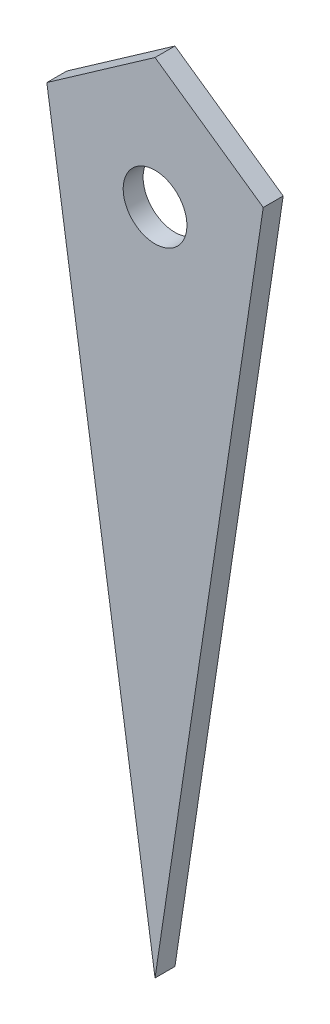
ISO-10303-21;
HEADER;
FILE_DESCRIPTION(('STEP AP214'),'2;1');
FILE_NAME('part.step','',(''),(''),'','','');
FILE_SCHEMA(('AUTOMOTIVE_DESIGN { 1 0 10303 214 1 1 1 1 }'));
ENDSEC;
DATA;
#1=APPLICATION_CONTEXT('core data for automotive mechanical design processes');
#2=APPLICATION_PROTOCOL_DEFINITION('international standard','automotive_design',2000,#1);
#3=PRODUCT_CONTEXT('',#1,'mechanical');
#4=PRODUCT('Part','Part','',(#3));
#5=PRODUCT_RELATED_PRODUCT_CATEGORY('part','',(#4));
#6=PRODUCT_DEFINITION_FORMATION('','',#4);
#7=PRODUCT_DEFINITION_CONTEXT('part definition',#1,'design');
#8=PRODUCT_DEFINITION('design','',#6,#7);
#9=PRODUCT_DEFINITION_SHAPE('','',#8);
#10=(LENGTH_UNIT() NAMED_UNIT(*) SI_UNIT(.MILLI.,.METRE.));
#11=(NAMED_UNIT(*) PLANE_ANGLE_UNIT() SI_UNIT($,.RADIAN.));
#12=(NAMED_UNIT(*) SI_UNIT($,.STERADIAN.) SOLID_ANGLE_UNIT());
#13=UNCERTAINTY_MEASURE_WITH_UNIT(LENGTH_MEASURE(1.E-05),#10,'distance_accuracy_value','');
#14=(GEOMETRIC_REPRESENTATION_CONTEXT(3) GLOBAL_UNCERTAINTY_ASSIGNED_CONTEXT((#13)) GLOBAL_UNIT_ASSIGNED_CONTEXT((#10,
#11,#12)) REPRESENTATION_CONTEXT('',''));
#15=CARTESIAN_POINT('',(0.,0.,0.));
#16=DIRECTION('',(0.,0.,1.));
#17=DIRECTION('',(1.,0.,0.));
#18=AXIS2_PLACEMENT_3D('',#15,#16,#17);
#19=CARTESIAN_POINT('',(60.,400.,-10.));
#20=DIRECTION('',(0.988936352868298,-0.148340452930245,0.));
#21=DIRECTION('',(0.148340452930245,0.988936352868298,0.));
#22=AXIS2_PLACEMENT_3D('',#19,#20,#21);
#23=PLANE('',#22);
#24=DIRECTION('',(0.148340452930245,0.988936352868298,0.));
#25=VECTOR('',#24,1.);
#26=CARTESIAN_POINT('',(60.,400.,-10.));
#27=LINE('',#26,#25);
#28=CARTESIAN_POINT('',(0.,0.,-10.));
#29=VERTEX_POINT('',#28);
#30=CARTESIAN_POINT('',(54.2971128426798,361.980752284533,-10.));
#31=VERTEX_POINT('',#30);
#32=EDGE_CURVE('E123',#29,#31,#27,.T.);
#33=ORIENTED_EDGE('',*,*,#32,.T.);
#34=DIRECTION('',(0.,0.,-1.));
#35=VECTOR('',#34,1.);
#36=CARTESIAN_POINT('',(54.2971128426798,361.980752284533,0.));
#37=LINE('',#36,#35);
#38=CARTESIAN_POINT('',(54.2971128426798,361.980752284533,0.));
#39=VERTEX_POINT('',#38);
#40=EDGE_CURVE('E113',#39,#31,#37,.T.);
#41=ORIENTED_EDGE('',*,*,#40,.F.);
#42=DIRECTION('',(0.148340452930245,0.988936352868298,0.));
#43=VECTOR('',#42,1.);
#44=CARTESIAN_POINT('',(60.,400.,0.));
#45=LINE('',#44,#43);
#46=CARTESIAN_POINT('',(0.,0.,0.));
#47=VERTEX_POINT('',#46);
#48=EDGE_CURVE('E112',#47,#39,#45,.T.);
#49=ORIENTED_EDGE('',*,*,#48,.F.);
#50=DIRECTION('',(0.,0.,1.));
#51=VECTOR('',#50,1.);
#52=CARTESIAN_POINT('',(0.,0.,-10.));
#53=LINE('',#52,#51);
#54=EDGE_CURVE('E12',#29,#47,#53,.T.);
#55=ORIENTED_EDGE('',*,*,#54,.F.);
#56=EDGE_LOOP('',(#33,#41,#49,#55));
#57=FACE_BOUND('',#56,.T.);
#58=ADVANCED_FACE('F58',(#57),#23,.T.);
#59=CARTESIAN_POINT('',(0.,0.,-10.));
#60=DIRECTION('',(0.,0.,1.));
#61=DIRECTION('',(1.,0.,0.));
#62=AXIS2_PLACEMENT_3D('',#59,#60,#61);
#63=PLANE('',#62);
#64=CARTESIAN_POINT('',(0.,335.,-10.));
#65=DIRECTION('',(0.,0.,-1.));
#66=DIRECTION('',(-1.,0.,0.));
#67=AXIS2_PLACEMENT_3D('',#64,#65,#66);
#68=CIRCLE('',#67,16.);
#69=CARTESIAN_POINT('',(-16.,335.,-10.));
#70=VERTEX_POINT('',#69);
#71=EDGE_CURVE('E135',#70,#70,#68,.T.);
#72=ORIENTED_EDGE('',*,*,#71,.F.);
#73=EDGE_LOOP('',(#72));
#74=FACE_BOUND('',#73,.T.);
#75=DIRECTION('',(0.819152044288993,-0.573576436351044,0.));
#76=VECTOR('',#75,1.);
#77=CARTESIAN_POINT('',(187.938524157181,268.404028665135,-10.));
#78=LINE('',#77,#76);
#79=CARTESIAN_POINT('',(2.65326929697669E-13,400.,-10.));
#80=VERTEX_POINT('',#79);
#81=EDGE_CURVE('E103',#80,#31,#78,.T.);
#82=ORIENTED_EDGE('',*,*,#81,.T.);
#83=ORIENTED_EDGE('',*,*,#32,.F.);
#84=DIRECTION('',(0.148340452930245,-0.988936352868298,0.));
#85=VECTOR('',#84,1.);
#86=CARTESIAN_POINT('',(0.,0.,-10.));
#87=LINE('',#86,#85);
#88=CARTESIAN_POINT('',(-54.2971128426799,361.980752284532,-10.));
#89=VERTEX_POINT('',#88);
#90=EDGE_CURVE('E65',#89,#29,#87,.T.);
#91=ORIENTED_EDGE('',*,*,#90,.F.);
#92=DIRECTION('',(-0.819152044288994,-0.573576436351044,0.));
#93=VECTOR('',#92,1.);
#94=CARTESIAN_POINT('',(-187.938524157181,268.404028665135,-10.));
#95=LINE('',#94,#93);
#96=EDGE_CURVE('E116',#80,#89,#95,.T.);
#97=ORIENTED_EDGE('',*,*,#96,.F.);
#98=EDGE_LOOP('',(#82,#83,#91,#97));
#99=FACE_BOUND('',#98,.T.);
#100=ADVANCED_FACE('F132',(#74,#99),#63,.F.);
#101=CARTESIAN_POINT('',(0.,0.,0.));
#102=DIRECTION('',(0.,0.,1.));
#103=DIRECTION('',(1.,0.,0.));
#104=AXIS2_PLACEMENT_3D('',#101,#102,#103);
#105=PLANE('',#104);
#106=CARTESIAN_POINT('',(0.,335.,0.));
#107=DIRECTION('',(0.,0.,-1.));
#108=DIRECTION('',(-1.,0.,0.));
#109=AXIS2_PLACEMENT_3D('',#106,#107,#108);
#110=CIRCLE('',#109,16.);
#111=CARTESIAN_POINT('',(-16.,335.,0.));
#112=VERTEX_POINT('',#111);
#113=EDGE_CURVE('E133',#112,#112,#110,.T.);
#114=ORIENTED_EDGE('',*,*,#113,.T.);
#115=EDGE_LOOP('',(#114));
#116=FACE_BOUND('',#115,.T.);
#117=ORIENTED_EDGE('',*,*,#48,.T.);
#118=DIRECTION('',(0.819152044288993,-0.573576436351044,0.));
#119=VECTOR('',#118,1.);
#120=CARTESIAN_POINT('',(187.938524157181,268.404028665135,0.));
#121=LINE('',#120,#119);
#122=CARTESIAN_POINT('',(2.65326929697669E-13,400.,0.));
#123=VERTEX_POINT('',#122);
#124=EDGE_CURVE('E100',#123,#39,#121,.T.);
#125=ORIENTED_EDGE('',*,*,#124,.F.);
#126=DIRECTION('',(-0.819152044288994,-0.573576436351044,0.));
#127=VECTOR('',#126,1.);
#128=CARTESIAN_POINT('',(-187.938524157181,268.404028665135,0.));
#129=LINE('',#128,#127);
#130=CARTESIAN_POINT('',(-54.2971128426799,361.980752284532,0.));
#131=VERTEX_POINT('',#130);
#132=EDGE_CURVE('E105',#123,#131,#129,.T.);
#133=ORIENTED_EDGE('',*,*,#132,.T.);
#134=DIRECTION('',(0.148340452930245,-0.988936352868298,0.));
#135=VECTOR('',#134,1.);
#136=CARTESIAN_POINT('',(0.,0.,0.));
#137=LINE('',#136,#135);
#138=EDGE_CURVE('E126',#131,#47,#137,.T.);
#139=ORIENTED_EDGE('',*,*,#138,.T.);
#140=EDGE_LOOP('',(#117,#125,#133,#139));
#141=FACE_BOUND('',#140,.T.);
#142=ADVANCED_FACE('F109',(#116,#141),#105,.T.);
#143=CARTESIAN_POINT('',(0.,0.,-10.));
#144=DIRECTION('',(-0.988936352868298,-0.148340452930245,0.));
#145=DIRECTION('',(0.148340452930245,-0.988936352868298,0.));
#146=AXIS2_PLACEMENT_3D('',#143,#144,#145);
#147=PLANE('',#146);
#148=DIRECTION('',(0.,0.,-1.));
#149=VECTOR('',#148,1.);
#150=CARTESIAN_POINT('',(-54.2971128426799,361.980752284532,0.));
#151=LINE('',#150,#149);
#152=EDGE_CURVE('E72',#131,#89,#151,.T.);
#153=ORIENTED_EDGE('',*,*,#152,.T.);
#154=ORIENTED_EDGE('',*,*,#90,.T.);
#155=ORIENTED_EDGE('',*,*,#54,.T.);
#156=ORIENTED_EDGE('',*,*,#138,.F.);
#157=EDGE_LOOP('',(#153,#154,#155,#156));
#158=FACE_BOUND('',#157,.T.);
#159=ADVANCED_FACE('F128',(#158),#147,.T.);
#160=CARTESIAN_POINT('',(-187.938524157181,268.404028665135,0.));
#161=DIRECTION('',(0.573576436351044,-0.819152044288993,0.));
#162=DIRECTION('',(0.819152044288993,0.573576436351044,0.));
#163=AXIS2_PLACEMENT_3D('',#160,#161,#162);
#164=PLANE('',#163);
#165=ORIENTED_EDGE('',*,*,#96,.T.);
#166=ORIENTED_EDGE('',*,*,#152,.F.);
#167=ORIENTED_EDGE('',*,*,#132,.F.);
#168=DIRECTION('',(0.,0.,-1.));
#169=VECTOR('',#168,1.);
#170=CARTESIAN_POINT('',(2.65326929697669E-13,400.,0.));
#171=LINE('',#170,#169);
#172=EDGE_CURVE('E97',#123,#80,#171,.T.);
#173=ORIENTED_EDGE('',*,*,#172,.T.);
#174=EDGE_LOOP('',(#165,#166,#167,#173));
#175=FACE_BOUND('',#174,.T.);
#176=ADVANCED_FACE('F115',(#175),#164,.F.);
#177=CARTESIAN_POINT('',(187.938524157181,268.404028665135,0.));
#178=DIRECTION('',(0.573576436351044,0.819152044288993,0.));
#179=DIRECTION('',(-0.819152044288993,0.573576436351044,0.));
#180=AXIS2_PLACEMENT_3D('',#177,#178,#179);
#181=PLANE('',#180);
#182=ORIENTED_EDGE('',*,*,#81,.F.);
#183=ORIENTED_EDGE('',*,*,#172,.F.);
#184=ORIENTED_EDGE('',*,*,#124,.T.);
#185=ORIENTED_EDGE('',*,*,#40,.T.);
#186=EDGE_LOOP('',(#182,#183,#184,#185));
#187=FACE_BOUND('',#186,.T.);
#188=ADVANCED_FACE('F99',(#187),#181,.T.);
#189=CARTESIAN_POINT('',(0.,335.,0.));
#190=DIRECTION('',(0.,0.,-1.));
#191=DIRECTION('',(-1.,0.,0.));
#192=AXIS2_PLACEMENT_3D('',#189,#190,#191);
#193=CYLINDRICAL_SURFACE('',#192,16.);
#194=ORIENTED_EDGE('',*,*,#113,.F.);
#195=EDGE_LOOP('',(#194));
#196=FACE_BOUND('',#195,.T.);
#197=ORIENTED_EDGE('',*,*,#71,.T.);
#198=EDGE_LOOP('',(#197));
#199=FACE_BOUND('',#198,.T.);
#200=ADVANCED_FACE('F141',(#196,#199),#193,.F.);
#201=CLOSED_SHELL('',(#58,#100,#142,#159,#176,#188,#200));
#202=MANIFOLD_SOLID_BREP('B2',#201);
#203=ADVANCED_BREP_SHAPE_REPRESENTATION('',(#18,#202),#14);
#204=SHAPE_DEFINITION_REPRESENTATION(#9,#203);
ENDSEC;
END-ISO-10303-21;
